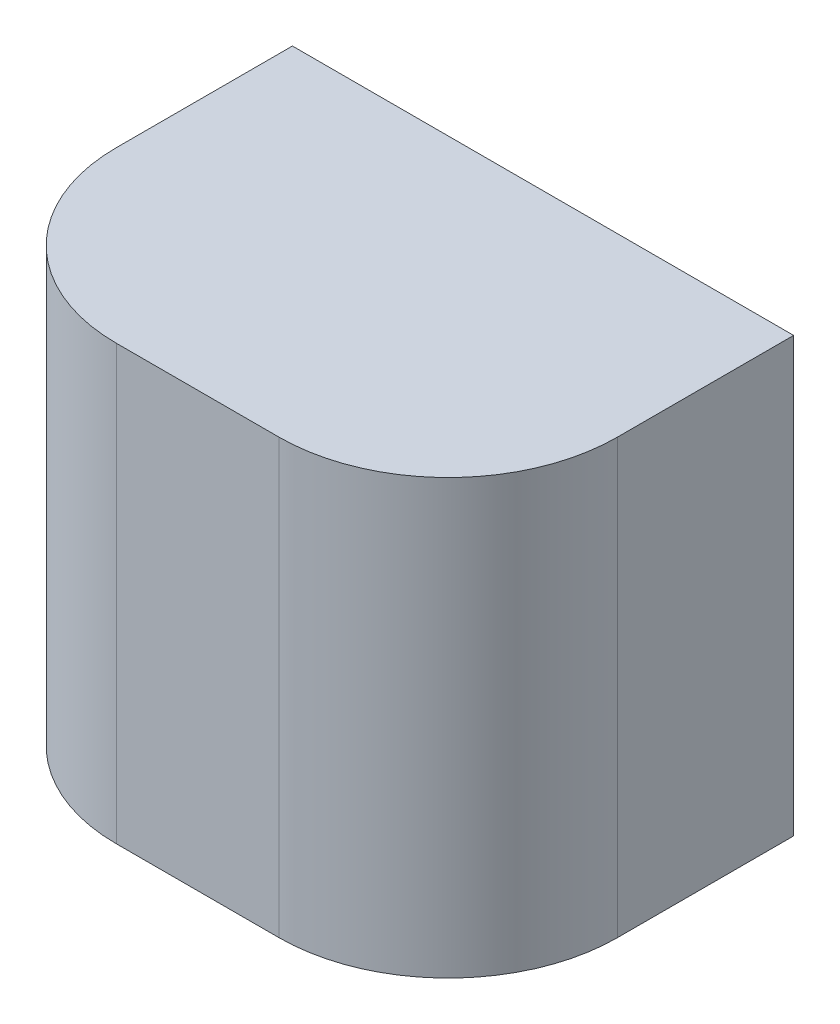
ISO-10303-21;
HEADER;
FILE_DESCRIPTION(('STEP AP214'),'2;1');
FILE_NAME('part.step','',(''),(''),'','','');
FILE_SCHEMA(('AUTOMOTIVE_DESIGN { 1 0 10303 214 1 1 1 1 }'));
ENDSEC;
DATA;
#1=APPLICATION_CONTEXT('core data for automotive mechanical design processes');
#2=APPLICATION_PROTOCOL_DEFINITION('international standard','automotive_design',2000,#1);
#3=PRODUCT_CONTEXT('',#1,'mechanical');
#4=PRODUCT('Part','Part','',(#3));
#5=PRODUCT_RELATED_PRODUCT_CATEGORY('part','',(#4));
#6=PRODUCT_DEFINITION_FORMATION('','',#4);
#7=PRODUCT_DEFINITION_CONTEXT('part definition',#1,'design');
#8=PRODUCT_DEFINITION('design','',#6,#7);
#9=PRODUCT_DEFINITION_SHAPE('','',#8);
#10=(LENGTH_UNIT() NAMED_UNIT(*) SI_UNIT(.MILLI.,.METRE.));
#11=(NAMED_UNIT(*) PLANE_ANGLE_UNIT() SI_UNIT($,.RADIAN.));
#12=(NAMED_UNIT(*) SI_UNIT($,.STERADIAN.) SOLID_ANGLE_UNIT());
#13=UNCERTAINTY_MEASURE_WITH_UNIT(LENGTH_MEASURE(1.E-05),#10,'distance_accuracy_value','');
#14=(GEOMETRIC_REPRESENTATION_CONTEXT(3) GLOBAL_UNCERTAINTY_ASSIGNED_CONTEXT((#13)) GLOBAL_UNIT_ASSIGNED_CONTEXT((#10,
#11,#12)) REPRESENTATION_CONTEXT('',''));
#15=CARTESIAN_POINT('',(0.,0.,0.));
#16=DIRECTION('',(0.,0.,1.));
#17=DIRECTION('',(1.,0.,0.));
#18=AXIS2_PLACEMENT_3D('',#15,#16,#17);
#19=CARTESIAN_POINT('',(-0.37,0.,1.395));
#20=DIRECTION('',(-1.,0.,0.));
#21=DIRECTION('',(0.,0.,1.));
#22=AXIS2_PLACEMENT_3D('',#19,#20,#21);
#23=PLANE('',#22);
#24=DIRECTION('',(0.,0.,-1.));
#25=VECTOR('',#24,1.);
#26=CARTESIAN_POINT('',(-0.37,-0.64,1.395));
#27=LINE('',#26,#25);
#28=CARTESIAN_POINT('',(-0.37,-0.64,1.655));
#29=VERTEX_POINT('',#28);
#30=CARTESIAN_POINT('',(-0.37,-0.64,1.395));
#31=VERTEX_POINT('',#30);
#32=EDGE_CURVE('E11',#29,#31,#27,.T.);
#33=ORIENTED_EDGE('',*,*,#32,.F.);
#34=DIRECTION('',(0.,-1.,0.));
#35=VECTOR('',#34,1.);
#36=CARTESIAN_POINT('',(-0.37,0.,1.655));
#37=LINE('',#36,#35);
#38=CARTESIAN_POINT('',(-0.37,0.,1.655));
#39=VERTEX_POINT('',#38);
#40=EDGE_CURVE('E24',#39,#29,#37,.T.);
#41=ORIENTED_EDGE('',*,*,#40,.F.);
#42=DIRECTION('',(0.,0.,-1.));
#43=VECTOR('',#42,1.);
#44=CARTESIAN_POINT('',(-0.37,0.,1.395));
#45=LINE('',#44,#43);
#46=CARTESIAN_POINT('',(-0.37,0.,1.395));
#47=VERTEX_POINT('',#46);
#48=EDGE_CURVE('E119',#39,#47,#45,.T.);
#49=ORIENTED_EDGE('',*,*,#48,.T.);
#50=DIRECTION('',(0.,-1.,0.));
#51=VECTOR('',#50,1.);
#52=CARTESIAN_POINT('',(-0.37,0.,1.395));
#53=LINE('',#52,#51);
#54=EDGE_CURVE('E90',#47,#31,#53,.T.);
#55=ORIENTED_EDGE('',*,*,#54,.T.);
#56=EDGE_LOOP('',(#33,#41,#49,#55));
#57=FACE_BOUND('',#56,.T.);
#58=ADVANCED_FACE('F17',(#57),#23,.T.);
#59=CARTESIAN_POINT('',(-0.12,0.,1.655));
#60=DIRECTION('',(0.,-1.,0.));
#61=DIRECTION('',(0.,0.,-1.));
#62=AXIS2_PLACEMENT_3D('',#59,#60,#61);
#63=CYLINDRICAL_SURFACE('',#62,0.25);
#64=CARTESIAN_POINT('',(-0.12,-0.64,1.655));
#65=DIRECTION('',(0.,-1.,0.));
#66=DIRECTION('',(0.,0.,1.));
#67=AXIS2_PLACEMENT_3D('',#64,#65,#66);
#68=CIRCLE('',#67,0.25);
#69=CARTESIAN_POINT('',(-0.119999999999998,-0.64,1.905));
#70=VERTEX_POINT('',#69);
#71=EDGE_CURVE('E116',#70,#29,#68,.T.);
#72=ORIENTED_EDGE('',*,*,#71,.F.);
#73=DIRECTION('',(0.,-1.,0.));
#74=VECTOR('',#73,1.);
#75=CARTESIAN_POINT('',(-0.119999999999998,0.,1.905));
#76=LINE('',#75,#74);
#77=CARTESIAN_POINT('',(-0.119999999999998,0.,1.905));
#78=VERTEX_POINT('',#77);
#79=EDGE_CURVE('E113',#78,#70,#76,.T.);
#80=ORIENTED_EDGE('',*,*,#79,.F.);
#81=CARTESIAN_POINT('',(-0.12,0.,1.655));
#82=DIRECTION('',(0.,-1.,0.));
#83=DIRECTION('',(0.,0.,1.));
#84=AXIS2_PLACEMENT_3D('',#81,#82,#83);
#85=CIRCLE('',#84,0.25);
#86=EDGE_CURVE('E110',#78,#39,#85,.T.);
#87=ORIENTED_EDGE('',*,*,#86,.T.);
#88=ORIENTED_EDGE('',*,*,#40,.T.);
#89=EDGE_LOOP('',(#72,#80,#87,#88));
#90=FACE_BOUND('',#89,.T.);
#91=ADVANCED_FACE('F121',(#90),#63,.T.);
#92=CARTESIAN_POINT('',(-0.119999999999998,0.,1.905));
#93=DIRECTION('',(0.,0.,1.));
#94=DIRECTION('',(1.,0.,0.));
#95=AXIS2_PLACEMENT_3D('',#92,#93,#94);
#96=PLANE('',#95);
#97=DIRECTION('',(-1.,0.,0.));
#98=VECTOR('',#97,1.);
#99=CARTESIAN_POINT('',(-0.119999999999998,-0.64,1.905));
#100=LINE('',#99,#98);
#101=CARTESIAN_POINT('',(0.120000000000007,-0.64,1.905));
#102=VERTEX_POINT('',#101);
#103=EDGE_CURVE('E107',#102,#70,#100,.T.);
#104=ORIENTED_EDGE('',*,*,#103,.F.);
#105=DIRECTION('',(0.,-1.,0.));
#106=VECTOR('',#105,1.);
#107=CARTESIAN_POINT('',(0.120000000000007,0.,1.905));
#108=LINE('',#107,#106);
#109=CARTESIAN_POINT('',(0.120000000000007,0.,1.905));
#110=VERTEX_POINT('',#109);
#111=EDGE_CURVE('E104',#110,#102,#108,.T.);
#112=ORIENTED_EDGE('',*,*,#111,.F.);
#113=DIRECTION('',(-1.,0.,0.));
#114=VECTOR('',#113,1.);
#115=CARTESIAN_POINT('',(-0.119999999999998,0.,1.905));
#116=LINE('',#115,#114);
#117=EDGE_CURVE('E101',#110,#78,#116,.T.);
#118=ORIENTED_EDGE('',*,*,#117,.T.);
#119=ORIENTED_EDGE('',*,*,#79,.T.);
#120=EDGE_LOOP('',(#104,#112,#118,#119));
#121=FACE_BOUND('',#120,.T.);
#122=ADVANCED_FACE('F125',(#121),#96,.T.);
#123=CARTESIAN_POINT('',(0.120000000000009,0.,1.655));
#124=DIRECTION('',(0.,-1.,0.));
#125=DIRECTION('',(0.,0.,-1.));
#126=AXIS2_PLACEMENT_3D('',#123,#124,#125);
#127=CYLINDRICAL_SURFACE('',#126,0.25);
#128=CARTESIAN_POINT('',(0.120000000000009,-0.64,1.655));
#129=DIRECTION('',(0.,-1.,0.));
#130=DIRECTION('',(0.,0.,1.));
#131=AXIS2_PLACEMENT_3D('',#128,#129,#130);
#132=CIRCLE('',#131,0.25);
#133=CARTESIAN_POINT('',(0.370000000000009,-0.64,1.655));
#134=VERTEX_POINT('',#133);
#135=EDGE_CURVE('E98',#134,#102,#132,.T.);
#136=ORIENTED_EDGE('',*,*,#135,.F.);
#137=DIRECTION('',(0.,-1.,0.));
#138=VECTOR('',#137,1.);
#139=CARTESIAN_POINT('',(0.370000000000009,0.,1.655));
#140=LINE('',#139,#138);
#141=CARTESIAN_POINT('',(0.370000000000009,0.,1.655));
#142=VERTEX_POINT('',#141);
#143=EDGE_CURVE('E96',#142,#134,#140,.T.);
#144=ORIENTED_EDGE('',*,*,#143,.F.);
#145=CARTESIAN_POINT('',(0.120000000000009,0.,1.655));
#146=DIRECTION('',(0.,-1.,0.));
#147=DIRECTION('',(0.,0.,1.));
#148=AXIS2_PLACEMENT_3D('',#145,#146,#147);
#149=CIRCLE('',#148,0.25);
#150=EDGE_CURVE('E85',#142,#110,#149,.T.);
#151=ORIENTED_EDGE('',*,*,#150,.T.);
#152=ORIENTED_EDGE('',*,*,#111,.T.);
#153=EDGE_LOOP('',(#136,#144,#151,#152));
#154=FACE_BOUND('',#153,.T.);
#155=ADVANCED_FACE('F127',(#154),#127,.T.);
#156=CARTESIAN_POINT('',(0.370000000000009,0.,1.395));
#157=DIRECTION('',(1.,0.,0.));
#158=DIRECTION('',(0.,0.,-1.));
#159=AXIS2_PLACEMENT_3D('',#156,#157,#158);
#160=PLANE('',#159);
#161=DIRECTION('',(0.,0.,1.));
#162=VECTOR('',#161,1.);
#163=CARTESIAN_POINT('',(0.370000000000009,-0.64,1.395));
#164=LINE('',#163,#162);
#165=CARTESIAN_POINT('',(0.370000000000009,-0.64,1.395));
#166=VERTEX_POINT('',#165);
#167=EDGE_CURVE('E72',#166,#134,#164,.T.);
#168=ORIENTED_EDGE('',*,*,#167,.F.);
#169=DIRECTION('',(0.,-1.,0.));
#170=VECTOR('',#169,1.);
#171=CARTESIAN_POINT('',(0.370000000000009,0.,1.395));
#172=LINE('',#171,#170);
#173=CARTESIAN_POINT('',(0.370000000000009,0.,1.395));
#174=VERTEX_POINT('',#173);
#175=EDGE_CURVE('E66',#174,#166,#172,.T.);
#176=ORIENTED_EDGE('',*,*,#175,.F.);
#177=DIRECTION('',(0.,0.,1.));
#178=VECTOR('',#177,1.);
#179=CARTESIAN_POINT('',(0.370000000000009,0.,1.395));
#180=LINE('',#179,#178);
#181=EDGE_CURVE('E70',#174,#142,#180,.T.);
#182=ORIENTED_EDGE('',*,*,#181,.T.);
#183=ORIENTED_EDGE('',*,*,#143,.T.);
#184=EDGE_LOOP('',(#168,#176,#182,#183));
#185=FACE_BOUND('',#184,.T.);
#186=ADVANCED_FACE('F68',(#185),#160,.T.);
#187=CARTESIAN_POINT('',(-0.37,0.,1.395));
#188=DIRECTION('',(0.,0.,-1.));
#189=DIRECTION('',(-1.,0.,0.));
#190=AXIS2_PLACEMENT_3D('',#187,#188,#189);
#191=PLANE('',#190);
#192=DIRECTION('',(1.,0.,0.));
#193=VECTOR('',#192,1.);
#194=CARTESIAN_POINT('',(-0.37,-0.64,1.395));
#195=LINE('',#194,#193);
#196=EDGE_CURVE('E86',#31,#166,#195,.T.);
#197=ORIENTED_EDGE('',*,*,#196,.F.);
#198=ORIENTED_EDGE('',*,*,#54,.F.);
#199=DIRECTION('',(1.,0.,0.));
#200=VECTOR('',#199,1.);
#201=CARTESIAN_POINT('',(-0.37,0.,1.395));
#202=LINE('',#201,#200);
#203=EDGE_CURVE('E82',#47,#174,#202,.T.);
#204=ORIENTED_EDGE('',*,*,#203,.T.);
#205=ORIENTED_EDGE('',*,*,#175,.T.);
#206=EDGE_LOOP('',(#197,#198,#204,#205));
#207=FACE_BOUND('',#206,.T.);
#208=ADVANCED_FACE('F89',(#207),#191,.T.);
#209=CARTESIAN_POINT('',(-0.12,0.,1.655));
#210=DIRECTION('',(0.,1.,0.));
#211=DIRECTION('',(0.,0.,1.));
#212=AXIS2_PLACEMENT_3D('',#209,#210,#211);
#213=PLANE('',#212);
#214=ORIENTED_EDGE('',*,*,#48,.F.);
#215=ORIENTED_EDGE('',*,*,#86,.F.);
#216=ORIENTED_EDGE('',*,*,#117,.F.);
#217=ORIENTED_EDGE('',*,*,#150,.F.);
#218=ORIENTED_EDGE('',*,*,#181,.F.);
#219=ORIENTED_EDGE('',*,*,#203,.F.);
#220=EDGE_LOOP('',(#214,#215,#216,#217,#218,#219));
#221=FACE_BOUND('',#220,.T.);
#222=ADVANCED_FACE('F81',(#221),#213,.T.);
#223=CARTESIAN_POINT('',(-0.12,-0.64,1.655));
#224=DIRECTION('',(0.,1.,0.));
#225=DIRECTION('',(0.,0.,1.));
#226=AXIS2_PLACEMENT_3D('',#223,#224,#225);
#227=PLANE('',#226);
#228=ORIENTED_EDGE('',*,*,#32,.T.);
#229=ORIENTED_EDGE('',*,*,#196,.T.);
#230=ORIENTED_EDGE('',*,*,#167,.T.);
#231=ORIENTED_EDGE('',*,*,#135,.T.);
#232=ORIENTED_EDGE('',*,*,#103,.T.);
#233=ORIENTED_EDGE('',*,*,#71,.T.);
#234=EDGE_LOOP('',(#228,#229,#230,#231,#232,#233));
#235=FACE_BOUND('',#234,.T.);
#236=ADVANCED_FACE('F123',(#235),#227,.F.);
#237=CLOSED_SHELL('',(#58,#91,#122,#155,#186,#208,#222,#236));
#238=MANIFOLD_SOLID_BREP('B1',#237);
#239=ADVANCED_BREP_SHAPE_REPRESENTATION('',(#18,#238),#14);
#240=SHAPE_DEFINITION_REPRESENTATION(#9,#239);
ENDSEC;
END-ISO-10303-21;
